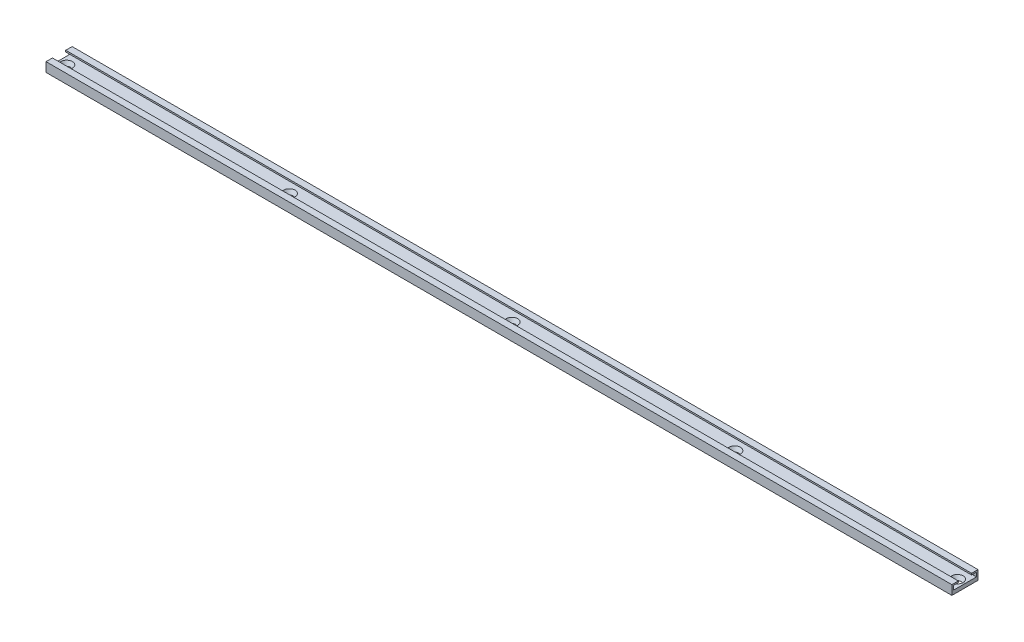
ISO-10303-21;
HEADER;
FILE_DESCRIPTION(('STEP AP214'),'2;1');
FILE_NAME('part.step','',(''),(''),'','','');
FILE_SCHEMA(('AUTOMOTIVE_DESIGN { 1 0 10303 214 1 1 1 1 }'));
ENDSEC;
DATA;
#1=APPLICATION_CONTEXT('core data for automotive mechanical design processes');
#2=APPLICATION_PROTOCOL_DEFINITION('international standard','automotive_design',2000,#1);
#3=PRODUCT_CONTEXT('',#1,'mechanical');
#4=PRODUCT('Part','Part','',(#3));
#5=PRODUCT_RELATED_PRODUCT_CATEGORY('part','',(#4));
#6=PRODUCT_DEFINITION_FORMATION('','',#4);
#7=PRODUCT_DEFINITION_CONTEXT('part definition',#1,'design');
#8=PRODUCT_DEFINITION('design','',#6,#7);
#9=PRODUCT_DEFINITION_SHAPE('','',#8);
#10=(LENGTH_UNIT() NAMED_UNIT(*) SI_UNIT(.MILLI.,.METRE.));
#11=(NAMED_UNIT(*) PLANE_ANGLE_UNIT() SI_UNIT($,.RADIAN.));
#12=(NAMED_UNIT(*) SI_UNIT($,.STERADIAN.) SOLID_ANGLE_UNIT());
#13=UNCERTAINTY_MEASURE_WITH_UNIT(LENGTH_MEASURE(1.E-05),#10,'distance_accuracy_value','');
#14=(GEOMETRIC_REPRESENTATION_CONTEXT(3) GLOBAL_UNCERTAINTY_ASSIGNED_CONTEXT((#13)) GLOBAL_UNIT_ASSIGNED_CONTEXT((#10,
#11,#12)) REPRESENTATION_CONTEXT('',''));
#15=CARTESIAN_POINT('',(0.,0.,0.));
#16=DIRECTION('',(0.,0.,1.));
#17=DIRECTION('',(1.,0.,0.));
#18=AXIS2_PLACEMENT_3D('',#15,#16,#17);
#19=CARTESIAN_POINT('',(1000.,3.7,4.4));
#20=DIRECTION('',(0.,-1.,0.));
#21=DIRECTION('',(0.,0.,-1.));
#22=AXIS2_PLACEMENT_3D('',#19,#20,#21);
#23=PLANE('',#22);
#24=DIRECTION('',(-1.,0.,0.));
#25=VECTOR('',#24,1.);
#26=CARTESIAN_POINT('',(1000.,3.7,8.65));
#27=LINE('',#26,#25);
#28=CARTESIAN_POINT('',(0.,3.7,8.65));
#29=VERTEX_POINT('',#28);
#30=CARTESIAN_POINT('',(-600.,3.7,8.65));
#31=VERTEX_POINT('',#30);
#32=EDGE_CURVE('E326',#29,#31,#27,.T.);
#33=ORIENTED_EDGE('',*,*,#32,.F.);
#34=DIRECTION('',(0.,0.,-1.));
#35=VECTOR('',#34,1.);
#36=CARTESIAN_POINT('',(0.,3.7,4.4));
#37=LINE('',#36,#35);
#38=CARTESIAN_POINT('',(0.,3.7,4.4));
#39=VERTEX_POINT('',#38);
#40=EDGE_CURVE('E426',#29,#39,#37,.T.);
#41=ORIENTED_EDGE('',*,*,#40,.T.);
#42=DIRECTION('',(-1.,0.,0.));
#43=VECTOR('',#42,1.);
#44=CARTESIAN_POINT('',(1000.,3.7,4.4));
#45=LINE('',#44,#43);
#46=CARTESIAN_POINT('',(-600.,3.7,4.4));
#47=VERTEX_POINT('',#46);
#48=EDGE_CURVE('E343',#39,#47,#45,.T.);
#49=ORIENTED_EDGE('',*,*,#48,.T.);
#50=DIRECTION('',(0.,0.,-1.));
#51=VECTOR('',#50,1.);
#52=CARTESIAN_POINT('',(-600.,3.7,8.65));
#53=LINE('',#52,#51);
#54=EDGE_CURVE('E424',#31,#47,#53,.T.);
#55=ORIENTED_EDGE('',*,*,#54,.F.);
#56=EDGE_LOOP('',(#33,#41,#49,#55));
#57=FACE_BOUND('',#56,.T.);
#58=ADVANCED_FACE('F54',(#57),#23,.F.);
#59=CARTESIAN_POINT('',(1000.,3.7,8.65));
#60=DIRECTION('',(0.,0.,-1.));
#61=DIRECTION('',(-1.,0.,0.));
#62=AXIS2_PLACEMENT_3D('',#59,#60,#61);
#63=PLANE('',#62);
#64=DIRECTION('',(-1.,0.,0.));
#65=VECTOR('',#64,1.);
#66=CARTESIAN_POINT('',(1000.,-2.5,8.65));
#67=LINE('',#66,#65);
#68=CARTESIAN_POINT('',(0.,-2.5,8.65));
#69=VERTEX_POINT('',#68);
#70=CARTESIAN_POINT('',(-600.,-2.5,8.65));
#71=VERTEX_POINT('',#70);
#72=EDGE_CURVE('E77',#69,#71,#67,.T.);
#73=ORIENTED_EDGE('',*,*,#72,.F.);
#74=DIRECTION('',(0.,1.,0.));
#75=VECTOR('',#74,1.);
#76=CARTESIAN_POINT('',(0.,3.7,8.65));
#77=LINE('',#76,#75);
#78=EDGE_CURVE('E70',#69,#29,#77,.T.);
#79=ORIENTED_EDGE('',*,*,#78,.T.);
#80=ORIENTED_EDGE('',*,*,#32,.T.);
#81=DIRECTION('',(0.,1.,0.));
#82=VECTOR('',#81,1.);
#83=CARTESIAN_POINT('',(-600.,-2.5,8.65));
#84=LINE('',#83,#82);
#85=EDGE_CURVE('E431',#71,#31,#84,.T.);
#86=ORIENTED_EDGE('',*,*,#85,.F.);
#87=EDGE_LOOP('',(#73,#79,#80,#86));
#88=FACE_BOUND('',#87,.T.);
#89=ADVANCED_FACE('F455',(#88),#63,.F.);
#90=CARTESIAN_POINT('',(1000.,2.7,4.4));
#91=DIRECTION('',(0.,0.,1.));
#92=DIRECTION('',(1.,0.,0.));
#93=AXIS2_PLACEMENT_3D('',#90,#91,#92);
#94=PLANE('',#93);
#95=ORIENTED_EDGE('',*,*,#48,.F.);
#96=DIRECTION('',(0.,-1.,0.));
#97=VECTOR('',#96,1.);
#98=CARTESIAN_POINT('',(0.,2.7,4.4));
#99=LINE('',#98,#97);
#100=CARTESIAN_POINT('',(0.,2.7,4.4));
#101=VERTEX_POINT('',#100);
#102=EDGE_CURVE('E459',#39,#101,#99,.T.);
#103=ORIENTED_EDGE('',*,*,#102,.T.);
#104=DIRECTION('',(-1.,0.,0.));
#105=VECTOR('',#104,1.);
#106=CARTESIAN_POINT('',(1000.,2.7,4.4));
#107=LINE('',#106,#105);
#108=CARTESIAN_POINT('',(-600.,2.7,4.4));
#109=VERTEX_POINT('',#108);
#110=EDGE_CURVE('E407',#101,#109,#107,.T.);
#111=ORIENTED_EDGE('',*,*,#110,.T.);
#112=DIRECTION('',(0.,-1.,0.));
#113=VECTOR('',#112,1.);
#114=CARTESIAN_POINT('',(-600.,3.7,4.4));
#115=LINE('',#114,#113);
#116=EDGE_CURVE('E429',#47,#109,#115,.T.);
#117=ORIENTED_EDGE('',*,*,#116,.F.);
#118=EDGE_LOOP('',(#95,#103,#111,#117));
#119=FACE_BOUND('',#118,.T.);
#120=ADVANCED_FACE('F433',(#119),#94,.F.);
#121=CARTESIAN_POINT('',(1000.,2.7,7.65));
#122=DIRECTION('',(0.,1.,0.));
#123=DIRECTION('',(0.,0.,1.));
#124=AXIS2_PLACEMENT_3D('',#121,#122,#123);
#125=PLANE('',#124);
#126=ORIENTED_EDGE('',*,*,#110,.F.);
#127=DIRECTION('',(0.,0.,1.));
#128=VECTOR('',#127,1.);
#129=CARTESIAN_POINT('',(0.,2.7,7.65));
#130=LINE('',#129,#128);
#131=CARTESIAN_POINT('',(0.,2.7,7.65));
#132=VERTEX_POINT('',#131);
#133=EDGE_CURVE('E461',#101,#132,#130,.T.);
#134=ORIENTED_EDGE('',*,*,#133,.T.);
#135=DIRECTION('',(-1.,0.,0.));
#136=VECTOR('',#135,1.);
#137=CARTESIAN_POINT('',(1000.,2.7,7.65));
#138=LINE('',#137,#136);
#139=CARTESIAN_POINT('',(-600.,2.7,7.65));
#140=VERTEX_POINT('',#139);
#141=EDGE_CURVE('E405',#132,#140,#138,.T.);
#142=ORIENTED_EDGE('',*,*,#141,.T.);
#143=DIRECTION('',(0.,0.,1.));
#144=VECTOR('',#143,1.);
#145=CARTESIAN_POINT('',(-600.,2.7,4.4));
#146=LINE('',#145,#144);
#147=EDGE_CURVE('E434',#109,#140,#146,.T.);
#148=ORIENTED_EDGE('',*,*,#147,.F.);
#149=EDGE_LOOP('',(#126,#134,#142,#148));
#150=FACE_BOUND('',#149,.T.);
#151=ADVANCED_FACE('F516',(#150),#125,.F.);
#152=CARTESIAN_POINT('',(1000.,0.,7.65));
#153=DIRECTION('',(0.,0.,1.));
#154=DIRECTION('',(1.,0.,0.));
#155=AXIS2_PLACEMENT_3D('',#152,#153,#154);
#156=PLANE('',#155);
#157=ORIENTED_EDGE('',*,*,#141,.F.);
#158=DIRECTION('',(0.,-1.,0.));
#159=VECTOR('',#158,1.);
#160=CARTESIAN_POINT('',(0.,0.,7.65));
#161=LINE('',#160,#159);
#162=CARTESIAN_POINT('',(0.,0.,7.65));
#163=VERTEX_POINT('',#162);
#164=EDGE_CURVE('E463',#132,#163,#161,.T.);
#165=ORIENTED_EDGE('',*,*,#164,.T.);
#166=DIRECTION('',(-1.,0.,0.));
#167=VECTOR('',#166,1.);
#168=CARTESIAN_POINT('',(1000.,0.,7.65));
#169=LINE('',#168,#167);
#170=CARTESIAN_POINT('',(-600.,0.,7.65));
#171=VERTEX_POINT('',#170);
#172=EDGE_CURVE('E296',#163,#171,#169,.T.);
#173=ORIENTED_EDGE('',*,*,#172,.T.);
#174=DIRECTION('',(0.,-1.,0.));
#175=VECTOR('',#174,1.);
#176=CARTESIAN_POINT('',(-600.,2.7,7.65));
#177=LINE('',#176,#175);
#178=EDGE_CURVE('E436',#140,#171,#177,.T.);
#179=ORIENTED_EDGE('',*,*,#178,.F.);
#180=EDGE_LOOP('',(#157,#165,#173,#179));
#181=FACE_BOUND('',#180,.T.);
#182=ADVANCED_FACE('F384',(#181),#156,.F.);
#183=CARTESIAN_POINT('',(1000.,0.,-7.65));
#184=DIRECTION('',(0.,-1.,0.));
#185=DIRECTION('',(0.,0.,-1.));
#186=AXIS2_PLACEMENT_3D('',#183,#184,#185);
#187=PLANE('',#186);
#188=CARTESIAN_POINT('',(-5.,0.,0.));
#189=DIRECTION('',(0.,-1.,0.));
#190=DIRECTION('',(0.,0.,-1.));
#191=AXIS2_PLACEMENT_3D('',#188,#189,#190);
#192=CIRCLE('',#191,3.83205080756906);
#193=CARTESIAN_POINT('',(-5.,0.,-3.83205080756906));
#194=VERTEX_POINT('',#193);
#195=EDGE_CURVE('E356',#194,#194,#192,.T.);
#196=ORIENTED_EDGE('',*,*,#195,.T.);
#197=EDGE_LOOP('',(#196));
#198=FACE_BOUND('',#197,.T.);
#199=CARTESIAN_POINT('',(-152.5,0.,0.));
#200=DIRECTION('',(0.,-1.,0.));
#201=DIRECTION('',(0.,0.,-1.));
#202=AXIS2_PLACEMENT_3D('',#199,#200,#201);
#203=CIRCLE('',#202,3.83205080756884);
#204=CARTESIAN_POINT('',(-152.5,0.,-3.83205080756884));
#205=VERTEX_POINT('',#204);
#206=EDGE_CURVE('E353',#205,#205,#203,.T.);
#207=ORIENTED_EDGE('',*,*,#206,.T.);
#208=EDGE_LOOP('',(#207));
#209=FACE_BOUND('',#208,.T.);
#210=CARTESIAN_POINT('',(-300.,0.,0.));
#211=DIRECTION('',(0.,-1.,0.));
#212=DIRECTION('',(0.,0.,-1.));
#213=AXIS2_PLACEMENT_3D('',#210,#211,#212);
#214=CIRCLE('',#213,3.83205080756896);
#215=CARTESIAN_POINT('',(-300.,0.,-3.83205080756896));
#216=VERTEX_POINT('',#215);
#217=EDGE_CURVE('E350',#216,#216,#214,.T.);
#218=ORIENTED_EDGE('',*,*,#217,.T.);
#219=EDGE_LOOP('',(#218));
#220=FACE_BOUND('',#219,.T.);
#221=CARTESIAN_POINT('',(-447.5,0.,0.));
#222=DIRECTION('',(0.,-1.,0.));
#223=DIRECTION('',(0.,0.,-1.));
#224=AXIS2_PLACEMENT_3D('',#221,#222,#223);
#225=CIRCLE('',#224,3.83205080756896);
#226=CARTESIAN_POINT('',(-447.5,0.,-3.83205080756896));
#227=VERTEX_POINT('',#226);
#228=EDGE_CURVE('E347',#227,#227,#225,.T.);
#229=ORIENTED_EDGE('',*,*,#228,.T.);
#230=EDGE_LOOP('',(#229));
#231=FACE_BOUND('',#230,.T.);
#232=CARTESIAN_POINT('',(-595.,0.,0.));
#233=DIRECTION('',(0.,-1.,0.));
#234=DIRECTION('',(0.,0.,-1.));
#235=AXIS2_PLACEMENT_3D('',#232,#233,#234);
#236=CIRCLE('',#235,3.83205080756895);
#237=CARTESIAN_POINT('',(-595.,0.,-3.83205080756895));
#238=VERTEX_POINT('',#237);
#239=EDGE_CURVE('E148',#238,#238,#236,.T.);
#240=ORIENTED_EDGE('',*,*,#239,.T.);
#241=EDGE_LOOP('',(#240));
#242=FACE_BOUND('',#241,.T.);
#243=ORIENTED_EDGE('',*,*,#172,.F.);
#244=DIRECTION('',(0.,0.,-1.));
#245=VECTOR('',#244,1.);
#246=CARTESIAN_POINT('',(0.,0.,-7.65));
#247=LINE('',#246,#245);
#248=CARTESIAN_POINT('',(0.,0.,-7.65));
#249=VERTEX_POINT('',#248);
#250=EDGE_CURVE('E396',#163,#249,#247,.T.);
#251=ORIENTED_EDGE('',*,*,#250,.T.);
#252=DIRECTION('',(-1.,0.,0.));
#253=VECTOR('',#252,1.);
#254=CARTESIAN_POINT('',(1000.,0.,-7.65));
#255=LINE('',#254,#253);
#256=CARTESIAN_POINT('',(-600.,0.,-7.65));
#257=VERTEX_POINT('',#256);
#258=EDGE_CURVE('E404',#249,#257,#255,.T.);
#259=ORIENTED_EDGE('',*,*,#258,.T.);
#260=DIRECTION('',(0.,0.,-1.));
#261=VECTOR('',#260,1.);
#262=CARTESIAN_POINT('',(-600.,0.,7.65));
#263=LINE('',#262,#261);
#264=EDGE_CURVE('E399',#171,#257,#263,.T.);
#265=ORIENTED_EDGE('',*,*,#264,.F.);
#266=EDGE_LOOP('',(#243,#251,#259,#265));
#267=FACE_BOUND('',#266,.T.);
#268=ADVANCED_FACE('F380',(#198,#209,#220,#231,#242,#267),#187,.F.);
#269=CARTESIAN_POINT('',(1000.,2.7,-7.65));
#270=DIRECTION('',(0.,0.,-1.));
#271=DIRECTION('',(-1.,0.,0.));
#272=AXIS2_PLACEMENT_3D('',#269,#270,#271);
#273=PLANE('',#272);
#274=ORIENTED_EDGE('',*,*,#258,.F.);
#275=DIRECTION('',(0.,1.,0.));
#276=VECTOR('',#275,1.);
#277=CARTESIAN_POINT('',(0.,2.7,-7.65));
#278=LINE('',#277,#276);
#279=CARTESIAN_POINT('',(0.,2.7,-7.65));
#280=VERTEX_POINT('',#279);
#281=EDGE_CURVE('E466',#249,#280,#278,.T.);
#282=ORIENTED_EDGE('',*,*,#281,.T.);
#283=DIRECTION('',(-1.,0.,0.));
#284=VECTOR('',#283,1.);
#285=CARTESIAN_POINT('',(1000.,2.7,-7.65));
#286=LINE('',#285,#284);
#287=CARTESIAN_POINT('',(-600.,2.7,-7.65));
#288=VERTEX_POINT('',#287);
#289=EDGE_CURVE('E406',#280,#288,#286,.T.);
#290=ORIENTED_EDGE('',*,*,#289,.T.);
#291=DIRECTION('',(0.,1.,0.));
#292=VECTOR('',#291,1.);
#293=CARTESIAN_POINT('',(-600.,0.,-7.65));
#294=LINE('',#293,#292);
#295=EDGE_CURVE('E442',#257,#288,#294,.T.);
#296=ORIENTED_EDGE('',*,*,#295,.F.);
#297=EDGE_LOOP('',(#274,#282,#290,#296));
#298=FACE_BOUND('',#297,.T.);
#299=ADVANCED_FACE('F383',(#298),#273,.F.);
#300=CARTESIAN_POINT('',(1000.,2.7,-4.4));
#301=DIRECTION('',(0.,1.,0.));
#302=DIRECTION('',(0.,0.,1.));
#303=AXIS2_PLACEMENT_3D('',#300,#301,#302);
#304=PLANE('',#303);
#305=ORIENTED_EDGE('',*,*,#289,.F.);
#306=DIRECTION('',(0.,0.,1.));
#307=VECTOR('',#306,1.);
#308=CARTESIAN_POINT('',(0.,2.7,-4.4));
#309=LINE('',#308,#307);
#310=CARTESIAN_POINT('',(0.,2.7,-4.4));
#311=VERTEX_POINT('',#310);
#312=EDGE_CURVE('E469',#280,#311,#309,.T.);
#313=ORIENTED_EDGE('',*,*,#312,.T.);
#314=DIRECTION('',(-1.,0.,0.));
#315=VECTOR('',#314,1.);
#316=CARTESIAN_POINT('',(1000.,2.7,-4.4));
#317=LINE('',#316,#315);
#318=CARTESIAN_POINT('',(-600.,2.7,-4.4));
#319=VERTEX_POINT('',#318);
#320=EDGE_CURVE('E483',#311,#319,#317,.T.);
#321=ORIENTED_EDGE('',*,*,#320,.T.);
#322=DIRECTION('',(0.,0.,1.));
#323=VECTOR('',#322,1.);
#324=CARTESIAN_POINT('',(-600.,2.7,-7.65));
#325=LINE('',#324,#323);
#326=EDGE_CURVE('E445',#288,#319,#325,.T.);
#327=ORIENTED_EDGE('',*,*,#326,.F.);
#328=EDGE_LOOP('',(#305,#313,#321,#327));
#329=FACE_BOUND('',#328,.T.);
#330=ADVANCED_FACE('F496',(#329),#304,.F.);
#331=CARTESIAN_POINT('',(1000.,3.7,-4.4));
#332=DIRECTION('',(0.,0.,-1.));
#333=DIRECTION('',(-1.,0.,0.));
#334=AXIS2_PLACEMENT_3D('',#331,#332,#333);
#335=PLANE('',#334);
#336=ORIENTED_EDGE('',*,*,#320,.F.);
#337=DIRECTION('',(0.,1.,0.));
#338=VECTOR('',#337,1.);
#339=CARTESIAN_POINT('',(0.,3.7,-4.4));
#340=LINE('',#339,#338);
#341=CARTESIAN_POINT('',(0.,3.7,-4.4));
#342=VERTEX_POINT('',#341);
#343=EDGE_CURVE('E472',#311,#342,#340,.T.);
#344=ORIENTED_EDGE('',*,*,#343,.T.);
#345=DIRECTION('',(-1.,0.,0.));
#346=VECTOR('',#345,1.);
#347=CARTESIAN_POINT('',(1000.,3.7,-4.4));
#348=LINE('',#347,#346);
#349=CARTESIAN_POINT('',(-600.,3.7,-4.4));
#350=VERTEX_POINT('',#349);
#351=EDGE_CURVE('E162',#342,#350,#348,.T.);
#352=ORIENTED_EDGE('',*,*,#351,.T.);
#353=DIRECTION('',(0.,1.,0.));
#354=VECTOR('',#353,1.);
#355=CARTESIAN_POINT('',(-600.,2.7,-4.4));
#356=LINE('',#355,#354);
#357=EDGE_CURVE('E448',#319,#350,#356,.T.);
#358=ORIENTED_EDGE('',*,*,#357,.F.);
#359=EDGE_LOOP('',(#336,#344,#352,#358));
#360=FACE_BOUND('',#359,.T.);
#361=ADVANCED_FACE('F481',(#360),#335,.F.);
#362=CARTESIAN_POINT('',(1000.,3.7,-8.65));
#363=DIRECTION('',(0.,-1.,0.));
#364=DIRECTION('',(0.,0.,-1.));
#365=AXIS2_PLACEMENT_3D('',#362,#363,#364);
#366=PLANE('',#365);
#367=ORIENTED_EDGE('',*,*,#351,.F.);
#368=DIRECTION('',(0.,0.,-1.));
#369=VECTOR('',#368,1.);
#370=CARTESIAN_POINT('',(0.,3.7,-8.65));
#371=LINE('',#370,#369);
#372=CARTESIAN_POINT('',(0.,3.7,-8.65));
#373=VERTEX_POINT('',#372);
#374=EDGE_CURVE('E157',#342,#373,#371,.T.);
#375=ORIENTED_EDGE('',*,*,#374,.T.);
#376=DIRECTION('',(-1.,0.,0.));
#377=VECTOR('',#376,1.);
#378=CARTESIAN_POINT('',(1000.,3.7,-8.65));
#379=LINE('',#378,#377);
#380=CARTESIAN_POINT('',(-600.,3.7,-8.65));
#381=VERTEX_POINT('',#380);
#382=EDGE_CURVE('E156',#373,#381,#379,.T.);
#383=ORIENTED_EDGE('',*,*,#382,.T.);
#384=DIRECTION('',(0.,0.,-1.));
#385=VECTOR('',#384,1.);
#386=CARTESIAN_POINT('',(-600.,3.7,-4.4));
#387=LINE('',#386,#385);
#388=EDGE_CURVE('E451',#350,#381,#387,.T.);
#389=ORIENTED_EDGE('',*,*,#388,.F.);
#390=EDGE_LOOP('',(#367,#375,#383,#389));
#391=FACE_BOUND('',#390,.T.);
#392=ADVANCED_FACE('F477',(#391),#366,.F.);
#393=CARTESIAN_POINT('',(1000.,-2.5,-8.65));
#394=DIRECTION('',(0.,0.,1.));
#395=DIRECTION('',(1.,0.,0.));
#396=AXIS2_PLACEMENT_3D('',#393,#394,#395);
#397=PLANE('',#396);
#398=ORIENTED_EDGE('',*,*,#382,.F.);
#399=DIRECTION('',(0.,-1.,0.));
#400=VECTOR('',#399,1.);
#401=CARTESIAN_POINT('',(0.,-2.5,-8.65));
#402=LINE('',#401,#400);
#403=CARTESIAN_POINT('',(0.,-2.5,-8.65));
#404=VERTEX_POINT('',#403);
#405=EDGE_CURVE('E145',#373,#404,#402,.T.);
#406=ORIENTED_EDGE('',*,*,#405,.T.);
#407=DIRECTION('',(-1.,0.,0.));
#408=VECTOR('',#407,1.);
#409=CARTESIAN_POINT('',(1000.,-2.5,-8.65));
#410=LINE('',#409,#408);
#411=CARTESIAN_POINT('',(-600.,-2.5,-8.65));
#412=VERTEX_POINT('',#411);
#413=EDGE_CURVE('E149',#404,#412,#410,.T.);
#414=ORIENTED_EDGE('',*,*,#413,.T.);
#415=DIRECTION('',(0.,-1.,0.));
#416=VECTOR('',#415,1.);
#417=CARTESIAN_POINT('',(-600.,3.7,-8.65));
#418=LINE('',#417,#416);
#419=EDGE_CURVE('E453',#381,#412,#418,.T.);
#420=ORIENTED_EDGE('',*,*,#419,.F.);
#421=EDGE_LOOP('',(#398,#406,#414,#420));
#422=FACE_BOUND('',#421,.T.);
#423=ADVANCED_FACE('F153',(#422),#397,.F.);
#424=CARTESIAN_POINT('',(1000.,-2.5,8.65));
#425=DIRECTION('',(0.,1.,0.));
#426=DIRECTION('',(0.,0.,1.));
#427=AXIS2_PLACEMENT_3D('',#424,#425,#426);
#428=PLANE('',#427);
#429=CARTESIAN_POINT('',(-5.,-2.5,0.));
#430=DIRECTION('',(0.,1.,0.));
#431=DIRECTION('',(0.,0.,1.));
#432=AXIS2_PLACEMENT_3D('',#429,#430,#431);
#433=CIRCLE('',#432,2.38867513459497);
#434=CARTESIAN_POINT('',(-5.,-2.5,2.38867513459497));
#435=VERTEX_POINT('',#434);
#436=EDGE_CURVE('E12',#435,#435,#433,.T.);
#437=ORIENTED_EDGE('',*,*,#436,.T.);
#438=EDGE_LOOP('',(#437));
#439=FACE_BOUND('',#438,.T.);
#440=CARTESIAN_POINT('',(-152.5,-2.5,0.));
#441=DIRECTION('',(0.,1.,0.));
#442=DIRECTION('',(0.,0.,1.));
#443=AXIS2_PLACEMENT_3D('',#440,#441,#442);
#444=CIRCLE('',#443,2.38867513459476);
#445=CARTESIAN_POINT('',(-152.5,-2.5,2.38867513459476));
#446=VERTEX_POINT('',#445);
#447=EDGE_CURVE('E63',#446,#446,#444,.T.);
#448=ORIENTED_EDGE('',*,*,#447,.T.);
#449=EDGE_LOOP('',(#448));
#450=FACE_BOUND('',#449,.T.);
#451=CARTESIAN_POINT('',(-300.,-2.5,0.));
#452=DIRECTION('',(0.,1.,0.));
#453=DIRECTION('',(0.,0.,1.));
#454=AXIS2_PLACEMENT_3D('',#451,#452,#453);
#455=CIRCLE('',#454,2.38867513459487);
#456=CARTESIAN_POINT('',(-300.,-2.5,2.38867513459487));
#457=VERTEX_POINT('',#456);
#458=EDGE_CURVE('E365',#457,#457,#455,.T.);
#459=ORIENTED_EDGE('',*,*,#458,.T.);
#460=EDGE_LOOP('',(#459));
#461=FACE_BOUND('',#460,.T.);
#462=CARTESIAN_POINT('',(-447.5,-2.5,0.));
#463=DIRECTION('',(0.,1.,0.));
#464=DIRECTION('',(0.,0.,1.));
#465=AXIS2_PLACEMENT_3D('',#462,#463,#464);
#466=CIRCLE('',#465,2.38867513459487);
#467=CARTESIAN_POINT('',(-447.5,-2.5,2.38867513459487));
#468=VERTEX_POINT('',#467);
#469=EDGE_CURVE('E362',#468,#468,#466,.T.);
#470=ORIENTED_EDGE('',*,*,#469,.T.);
#471=EDGE_LOOP('',(#470));
#472=FACE_BOUND('',#471,.T.);
#473=CARTESIAN_POINT('',(-595.,-2.5,0.));
#474=DIRECTION('',(0.,1.,0.));
#475=DIRECTION('',(0.,0.,1.));
#476=AXIS2_PLACEMENT_3D('',#473,#474,#475);
#477=CIRCLE('',#476,2.38867513459487);
#478=CARTESIAN_POINT('',(-595.,-2.5,2.38867513459487));
#479=VERTEX_POINT('',#478);
#480=EDGE_CURVE('E359',#479,#479,#477,.T.);
#481=ORIENTED_EDGE('',*,*,#480,.T.);
#482=EDGE_LOOP('',(#481));
#483=FACE_BOUND('',#482,.T.);
#484=ORIENTED_EDGE('',*,*,#413,.F.);
#485=DIRECTION('',(0.,0.,1.));
#486=VECTOR('',#485,1.);
#487=CARTESIAN_POINT('',(0.,-2.5,8.65));
#488=LINE('',#487,#486);
#489=EDGE_CURVE('E142',#404,#69,#488,.T.);
#490=ORIENTED_EDGE('',*,*,#489,.T.);
#491=ORIENTED_EDGE('',*,*,#72,.T.);
#492=DIRECTION('',(0.,0.,1.));
#493=VECTOR('',#492,1.);
#494=CARTESIAN_POINT('',(-600.,-2.5,-8.65));
#495=LINE('',#494,#493);
#496=EDGE_CURVE('E160',#412,#71,#495,.T.);
#497=ORIENTED_EDGE('',*,*,#496,.F.);
#498=EDGE_LOOP('',(#484,#490,#491,#497));
#499=FACE_BOUND('',#498,.T.);
#500=ADVANCED_FACE('F159',(#439,#450,#461,#472,#483,#499),#428,.F.);
#501=CARTESIAN_POINT('',(-600.,0.,0.));
#502=DIRECTION('',(-1.,0.,0.));
#503=DIRECTION('',(0.,0.,1.));
#504=AXIS2_PLACEMENT_3D('',#501,#502,#503);
#505=PLANE('',#504);
#506=ORIENTED_EDGE('',*,*,#85,.T.);
#507=ORIENTED_EDGE('',*,*,#54,.T.);
#508=ORIENTED_EDGE('',*,*,#116,.T.);
#509=ORIENTED_EDGE('',*,*,#147,.T.);
#510=ORIENTED_EDGE('',*,*,#178,.T.);
#511=ORIENTED_EDGE('',*,*,#264,.T.);
#512=ORIENTED_EDGE('',*,*,#295,.T.);
#513=ORIENTED_EDGE('',*,*,#326,.T.);
#514=ORIENTED_EDGE('',*,*,#357,.T.);
#515=ORIENTED_EDGE('',*,*,#388,.T.);
#516=ORIENTED_EDGE('',*,*,#419,.T.);
#517=ORIENTED_EDGE('',*,*,#496,.T.);
#518=EDGE_LOOP('',(#506,#507,#508,#509,#510,#511,#512,#513,#514,#515,#516,#517));
#519=FACE_BOUND('',#518,.T.);
#520=ADVANCED_FACE('F428',(#519),#505,.T.);
#521=CARTESIAN_POINT('',(0.,0.,0.));
#522=DIRECTION('',(-1.,0.,0.));
#523=DIRECTION('',(0.,0.,1.));
#524=AXIS2_PLACEMENT_3D('',#521,#522,#523);
#525=PLANE('',#524);
#526=ORIENTED_EDGE('',*,*,#78,.F.);
#527=ORIENTED_EDGE('',*,*,#489,.F.);
#528=ORIENTED_EDGE('',*,*,#405,.F.);
#529=ORIENTED_EDGE('',*,*,#374,.F.);
#530=ORIENTED_EDGE('',*,*,#343,.F.);
#531=ORIENTED_EDGE('',*,*,#312,.F.);
#532=ORIENTED_EDGE('',*,*,#281,.F.);
#533=ORIENTED_EDGE('',*,*,#250,.F.);
#534=ORIENTED_EDGE('',*,*,#164,.F.);
#535=ORIENTED_EDGE('',*,*,#133,.F.);
#536=ORIENTED_EDGE('',*,*,#102,.F.);
#537=ORIENTED_EDGE('',*,*,#40,.F.);
#538=EDGE_LOOP('',(#526,#527,#528,#529,#530,#531,#532,#533,#534,#535,#536,#537));
#539=FACE_BOUND('',#538,.T.);
#540=ADVANCED_FACE('F144',(#539),#525,.F.);
#541=CARTESIAN_POINT('',(-5.,0.,0.));
#542=DIRECTION('',(0.,1.,0.));
#543=DIRECTION('',(0.,0.,1.));
#544=AXIS2_PLACEMENT_3D('',#541,#542,#543);
#545=CONICAL_SURFACE('',#544,3.83205080756906,0.523598775598305);
#546=ORIENTED_EDGE('',*,*,#436,.F.);
#547=EDGE_LOOP('',(#546));
#548=FACE_BOUND('',#547,.T.);
#549=ORIENTED_EDGE('',*,*,#195,.F.);
#550=EDGE_LOOP('',(#549));
#551=FACE_BOUND('',#550,.T.);
#552=ADVANCED_FACE('F376',(#548,#551),#545,.F.);
#553=CARTESIAN_POINT('',(-152.5,0.,0.));
#554=DIRECTION('',(0.,1.,0.));
#555=DIRECTION('',(0.,0.,1.));
#556=AXIS2_PLACEMENT_3D('',#553,#554,#555);
#557=CONICAL_SURFACE('',#556,3.83205080756884,0.523598775598305);
#558=ORIENTED_EDGE('',*,*,#447,.F.);
#559=EDGE_LOOP('',(#558));
#560=FACE_BOUND('',#559,.T.);
#561=ORIENTED_EDGE('',*,*,#206,.F.);
#562=EDGE_LOOP('',(#561));
#563=FACE_BOUND('',#562,.T.);
#564=ADVANCED_FACE('F372',(#560,#563),#557,.F.);
#565=CARTESIAN_POINT('',(-300.,0.,0.));
#566=DIRECTION('',(0.,1.,0.));
#567=DIRECTION('',(0.,0.,1.));
#568=AXIS2_PLACEMENT_3D('',#565,#566,#567);
#569=CONICAL_SURFACE('',#568,3.83205080756896,0.523598775598305);
#570=ORIENTED_EDGE('',*,*,#458,.F.);
#571=EDGE_LOOP('',(#570));
#572=FACE_BOUND('',#571,.T.);
#573=ORIENTED_EDGE('',*,*,#217,.F.);
#574=EDGE_LOOP('',(#573));
#575=FACE_BOUND('',#574,.T.);
#576=ADVANCED_FACE('F375',(#572,#575),#569,.F.);
#577=CARTESIAN_POINT('',(-447.5,0.,0.));
#578=DIRECTION('',(0.,1.,0.));
#579=DIRECTION('',(0.,0.,1.));
#580=AXIS2_PLACEMENT_3D('',#577,#578,#579);
#581=CONICAL_SURFACE('',#580,3.83205080756896,0.523598775598305);
#582=ORIENTED_EDGE('',*,*,#469,.F.);
#583=EDGE_LOOP('',(#582));
#584=FACE_BOUND('',#583,.T.);
#585=ORIENTED_EDGE('',*,*,#228,.F.);
#586=EDGE_LOOP('',(#585));
#587=FACE_BOUND('',#586,.T.);
#588=ADVANCED_FACE('F759',(#584,#587),#581,.F.);
#589=CARTESIAN_POINT('',(-595.,0.,0.));
#590=DIRECTION('',(0.,1.,0.));
#591=DIRECTION('',(0.,0.,1.));
#592=AXIS2_PLACEMENT_3D('',#589,#590,#591);
#593=CONICAL_SURFACE('',#592,3.83205080756895,0.523598775598305);
#594=ORIENTED_EDGE('',*,*,#480,.F.);
#595=EDGE_LOOP('',(#594));
#596=FACE_BOUND('',#595,.T.);
#597=ORIENTED_EDGE('',*,*,#239,.F.);
#598=EDGE_LOOP('',(#597));
#599=FACE_BOUND('',#598,.T.);
#600=ADVANCED_FACE('F57',(#596,#599),#593,.F.);
#601=CLOSED_SHELL('',(#58,#89,#120,#151,#182,#268,#299,#330,#361,#392,#423,#500,#520,#540,#552,
#564,#576,#588,#600));
#602=MANIFOLD_SOLID_BREP('B2',#601);
#603=ADVANCED_BREP_SHAPE_REPRESENTATION('',(#18,#602),#14);
#604=SHAPE_DEFINITION_REPRESENTATION(#9,#603);
ENDSEC;
END-ISO-10303-21;
